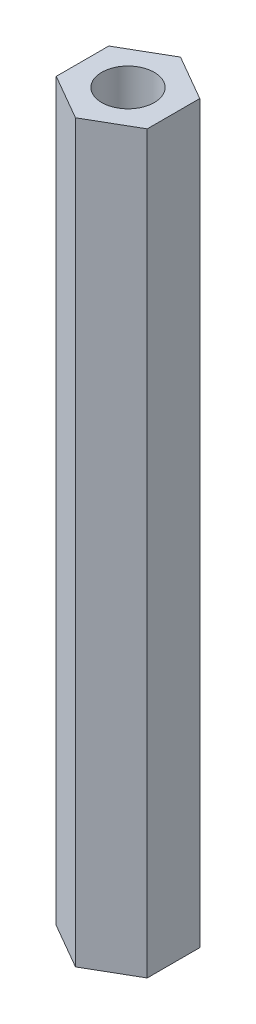
ISO-10303-21;
HEADER;
FILE_DESCRIPTION(('STEP AP214'),'2;1');
FILE_NAME('part.step','',(''),(''),'','','');
FILE_SCHEMA(('AUTOMOTIVE_DESIGN { 1 0 10303 214 1 1 1 1 }'));
ENDSEC;
DATA;
#1=APPLICATION_CONTEXT('core data for automotive mechanical design processes');
#2=APPLICATION_PROTOCOL_DEFINITION('international standard','automotive_design',2000,#1);
#3=PRODUCT_CONTEXT('',#1,'mechanical');
#4=PRODUCT('Part','Part','',(#3));
#5=PRODUCT_RELATED_PRODUCT_CATEGORY('part','',(#4));
#6=PRODUCT_DEFINITION_FORMATION('','',#4);
#7=PRODUCT_DEFINITION_CONTEXT('part definition',#1,'design');
#8=PRODUCT_DEFINITION('design','',#6,#7);
#9=PRODUCT_DEFINITION_SHAPE('','',#8);
#10=(LENGTH_UNIT() NAMED_UNIT(*) SI_UNIT(.MILLI.,.METRE.));
#11=(NAMED_UNIT(*) PLANE_ANGLE_UNIT() SI_UNIT($,.RADIAN.));
#12=(NAMED_UNIT(*) SI_UNIT($,.STERADIAN.) SOLID_ANGLE_UNIT());
#13=UNCERTAINTY_MEASURE_WITH_UNIT(LENGTH_MEASURE(1.E-05),#10,'distance_accuracy_value','');
#14=(GEOMETRIC_REPRESENTATION_CONTEXT(3) GLOBAL_UNCERTAINTY_ASSIGNED_CONTEXT((#13)) GLOBAL_UNIT_ASSIGNED_CONTEXT((#10,
#11,#12)) REPRESENTATION_CONTEXT('',''));
#15=CARTESIAN_POINT('',(0.,0.,0.));
#16=DIRECTION('',(0.,0.,1.));
#17=DIRECTION('',(1.,0.,0.));
#18=AXIS2_PLACEMENT_3D('',#15,#16,#17);
#19=CARTESIAN_POINT('',(0.,70.,-5.));
#20=DIRECTION('',(0.,1.,0.));
#21=DIRECTION('',(0.,0.,1.));
#22=AXIS2_PLACEMENT_3D('',#19,#20,#21);
#23=PLANE('',#22);
#24=DIRECTION('',(-0.866025403784439,0.,-0.5));
#25=VECTOR('',#24,1.);
#26=CARTESIAN_POINT('',(4.33012701892219,70.,-2.5));
#27=LINE('',#26,#25);
#28=CARTESIAN_POINT('',(4.33012701892219,70.,-2.5));
#29=VERTEX_POINT('',#28);
#30=CARTESIAN_POINT('',(0.,70.,-5.));
#31=VERTEX_POINT('',#30);
#32=EDGE_CURVE('E127',#29,#31,#27,.T.);
#33=ORIENTED_EDGE('',*,*,#32,.T.);
#34=DIRECTION('',(-0.866025403784439,0.,0.5));
#35=VECTOR('',#34,1.);
#36=CARTESIAN_POINT('',(0.,70.,-5.));
#37=LINE('',#36,#35);
#38=CARTESIAN_POINT('',(-4.33012701892219,70.,-2.5));
#39=VERTEX_POINT('',#38);
#40=EDGE_CURVE('E85',#31,#39,#37,.T.);
#41=ORIENTED_EDGE('',*,*,#40,.T.);
#42=DIRECTION('',(0.,0.,1.));
#43=VECTOR('',#42,1.);
#44=CARTESIAN_POINT('',(-4.33012701892219,70.,-2.5));
#45=LINE('',#44,#43);
#46=CARTESIAN_POINT('',(-4.33012701892219,70.,2.5));
#47=VERTEX_POINT('',#46);
#48=EDGE_CURVE('E98',#39,#47,#45,.T.);
#49=ORIENTED_EDGE('',*,*,#48,.T.);
#50=DIRECTION('',(0.866025403784439,0.,0.5));
#51=VECTOR('',#50,1.);
#52=CARTESIAN_POINT('',(-4.33012701892219,70.,2.5));
#53=LINE('',#52,#51);
#54=CARTESIAN_POINT('',(0.,70.,5.));
#55=VERTEX_POINT('',#54);
#56=EDGE_CURVE('E92',#47,#55,#53,.T.);
#57=ORIENTED_EDGE('',*,*,#56,.T.);
#58=DIRECTION('',(0.866025403784439,0.,-0.5));
#59=VECTOR('',#58,1.);
#60=CARTESIAN_POINT('',(0.,70.,5.));
#61=LINE('',#60,#59);
#62=CARTESIAN_POINT('',(4.33012701892219,70.,2.5));
#63=VERTEX_POINT('',#62);
#64=EDGE_CURVE('E96',#55,#63,#61,.T.);
#65=ORIENTED_EDGE('',*,*,#64,.T.);
#66=DIRECTION('',(0.,0.,-1.));
#67=VECTOR('',#66,1.);
#68=CARTESIAN_POINT('',(4.33012701892219,70.,2.5));
#69=LINE('',#68,#67);
#70=EDGE_CURVE('E48',#63,#29,#69,.T.);
#71=ORIENTED_EDGE('',*,*,#70,.T.);
#72=EDGE_LOOP('',(#33,#41,#49,#57,#65,#71));
#73=FACE_BOUND('',#72,.T.);
#74=CARTESIAN_POINT('',(0.,70.,0.));
#75=DIRECTION('',(0.,1.,0.));
#76=DIRECTION('',(0.,0.,1.));
#77=AXIS2_PLACEMENT_3D('',#74,#75,#76);
#78=CIRCLE('',#77,2.5);
#79=CARTESIAN_POINT('',(0.,70.,2.5));
#80=VERTEX_POINT('',#79);
#81=EDGE_CURVE('E120',#80,#80,#78,.T.);
#82=ORIENTED_EDGE('',*,*,#81,.F.);
#83=EDGE_LOOP('',(#82));
#84=FACE_BOUND('',#83,.T.);
#85=ADVANCED_FACE('F31',(#73,#84),#23,.T.);
#86=CARTESIAN_POINT('',(0.,0.,-5.));
#87=DIRECTION('',(0.,1.,0.));
#88=DIRECTION('',(0.,0.,1.));
#89=AXIS2_PLACEMENT_3D('',#86,#87,#88);
#90=PLANE('',#89);
#91=DIRECTION('',(-0.866025403784439,0.,-0.5));
#92=VECTOR('',#91,1.);
#93=CARTESIAN_POINT('',(4.33012701892219,0.,-2.5));
#94=LINE('',#93,#92);
#95=CARTESIAN_POINT('',(4.33012701892219,0.,-2.5));
#96=VERTEX_POINT('',#95);
#97=CARTESIAN_POINT('',(0.,0.,-5.));
#98=VERTEX_POINT('',#97);
#99=EDGE_CURVE('E116',#96,#98,#94,.T.);
#100=ORIENTED_EDGE('',*,*,#99,.F.);
#101=DIRECTION('',(0.,0.,-1.));
#102=VECTOR('',#101,1.);
#103=CARTESIAN_POINT('',(4.33012701892219,0.,2.5));
#104=LINE('',#103,#102);
#105=CARTESIAN_POINT('',(4.33012701892219,0.,2.5));
#106=VERTEX_POINT('',#105);
#107=EDGE_CURVE('E77',#106,#96,#104,.T.);
#108=ORIENTED_EDGE('',*,*,#107,.F.);
#109=DIRECTION('',(0.866025403784439,0.,-0.5));
#110=VECTOR('',#109,1.);
#111=CARTESIAN_POINT('',(0.,0.,5.));
#112=LINE('',#111,#110);
#113=CARTESIAN_POINT('',(0.,0.,5.));
#114=VERTEX_POINT('',#113);
#115=EDGE_CURVE('E71',#114,#106,#112,.T.);
#116=ORIENTED_EDGE('',*,*,#115,.F.);
#117=DIRECTION('',(0.866025403784439,0.,0.5));
#118=VECTOR('',#117,1.);
#119=CARTESIAN_POINT('',(-4.33012701892219,0.,2.5));
#120=LINE('',#119,#118);
#121=CARTESIAN_POINT('',(-4.33012701892219,0.,2.5));
#122=VERTEX_POINT('',#121);
#123=EDGE_CURVE('E106',#122,#114,#120,.T.);
#124=ORIENTED_EDGE('',*,*,#123,.F.);
#125=DIRECTION('',(0.,0.,1.));
#126=VECTOR('',#125,1.);
#127=CARTESIAN_POINT('',(-4.33012701892219,0.,-2.5));
#128=LINE('',#127,#126);
#129=CARTESIAN_POINT('',(-4.33012701892219,0.,-2.5));
#130=VERTEX_POINT('',#129);
#131=EDGE_CURVE('E122',#130,#122,#128,.T.);
#132=ORIENTED_EDGE('',*,*,#131,.F.);
#133=DIRECTION('',(-0.866025403784439,0.,0.5));
#134=VECTOR('',#133,1.);
#135=CARTESIAN_POINT('',(0.,0.,-5.));
#136=LINE('',#135,#134);
#137=EDGE_CURVE('E119',#98,#130,#136,.T.);
#138=ORIENTED_EDGE('',*,*,#137,.F.);
#139=EDGE_LOOP('',(#100,#108,#116,#124,#132,#138));
#140=FACE_BOUND('',#139,.T.);
#141=CARTESIAN_POINT('',(0.,0.,0.));
#142=DIRECTION('',(0.,1.,0.));
#143=DIRECTION('',(0.,0.,1.));
#144=AXIS2_PLACEMENT_3D('',#141,#142,#143);
#145=CIRCLE('',#144,2.5);
#146=CARTESIAN_POINT('',(0.,0.,2.5));
#147=VERTEX_POINT('',#146);
#148=EDGE_CURVE('E220',#147,#147,#145,.T.);
#149=ORIENTED_EDGE('',*,*,#148,.T.);
#150=EDGE_LOOP('',(#149));
#151=FACE_BOUND('',#150,.T.);
#152=ADVANCED_FACE('F136',(#140,#151),#90,.F.);
#153=CARTESIAN_POINT('',(4.33012701892219,70.,-2.5));
#154=DIRECTION('',(-0.5,0.,0.866025403784439));
#155=DIRECTION('',(0.866025403784439,0.,0.5));
#156=AXIS2_PLACEMENT_3D('',#153,#154,#155);
#157=PLANE('',#156);
#158=ORIENTED_EDGE('',*,*,#99,.T.);
#159=DIRECTION('',(0.,-1.,0.));
#160=VECTOR('',#159,1.);
#161=CARTESIAN_POINT('',(0.,70.,-5.));
#162=LINE('',#161,#160);
#163=EDGE_CURVE('E11',#31,#98,#162,.T.);
#164=ORIENTED_EDGE('',*,*,#163,.F.);
#165=ORIENTED_EDGE('',*,*,#32,.F.);
#166=DIRECTION('',(0.,-1.,0.));
#167=VECTOR('',#166,1.);
#168=CARTESIAN_POINT('',(4.33012701892219,70.,-2.5));
#169=LINE('',#168,#167);
#170=EDGE_CURVE('E112',#29,#96,#169,.T.);
#171=ORIENTED_EDGE('',*,*,#170,.T.);
#172=EDGE_LOOP('',(#158,#164,#165,#171));
#173=FACE_BOUND('',#172,.T.);
#174=ADVANCED_FACE('F33',(#173),#157,.F.);
#175=CARTESIAN_POINT('',(0.,70.,-5.));
#176=DIRECTION('',(0.5,0.,0.866025403784439));
#177=DIRECTION('',(0.866025403784439,0.,-0.5));
#178=AXIS2_PLACEMENT_3D('',#175,#176,#177);
#179=PLANE('',#178);
#180=ORIENTED_EDGE('',*,*,#137,.T.);
#181=DIRECTION('',(0.,-1.,0.));
#182=VECTOR('',#181,1.);
#183=CARTESIAN_POINT('',(-4.33012701892219,70.,-2.5));
#184=LINE('',#183,#182);
#185=EDGE_CURVE('E40',#39,#130,#184,.T.);
#186=ORIENTED_EDGE('',*,*,#185,.F.);
#187=ORIENTED_EDGE('',*,*,#40,.F.);
#188=ORIENTED_EDGE('',*,*,#163,.T.);
#189=EDGE_LOOP('',(#180,#186,#187,#188));
#190=FACE_BOUND('',#189,.T.);
#191=ADVANCED_FACE('F161',(#190),#179,.F.);
#192=CARTESIAN_POINT('',(-4.33012701892219,70.,-2.5));
#193=DIRECTION('',(1.,0.,0.));
#194=DIRECTION('',(0.,0.,-1.));
#195=AXIS2_PLACEMENT_3D('',#192,#193,#194);
#196=PLANE('',#195);
#197=ORIENTED_EDGE('',*,*,#131,.T.);
#198=DIRECTION('',(0.,-1.,0.));
#199=VECTOR('',#198,1.);
#200=CARTESIAN_POINT('',(-4.33012701892219,70.,2.5));
#201=LINE('',#200,#199);
#202=EDGE_CURVE('E107',#47,#122,#201,.T.);
#203=ORIENTED_EDGE('',*,*,#202,.F.);
#204=ORIENTED_EDGE('',*,*,#48,.F.);
#205=ORIENTED_EDGE('',*,*,#185,.T.);
#206=EDGE_LOOP('',(#197,#203,#204,#205));
#207=FACE_BOUND('',#206,.T.);
#208=ADVANCED_FACE('F133',(#207),#196,.F.);
#209=CARTESIAN_POINT('',(-4.33012701892219,70.,2.5));
#210=DIRECTION('',(0.5,0.,-0.866025403784439));
#211=DIRECTION('',(-0.866025403784439,0.,-0.5));
#212=AXIS2_PLACEMENT_3D('',#209,#210,#211);
#213=PLANE('',#212);
#214=ORIENTED_EDGE('',*,*,#123,.T.);
#215=DIRECTION('',(0.,-1.,0.));
#216=VECTOR('',#215,1.);
#217=CARTESIAN_POINT('',(0.,70.,5.));
#218=LINE('',#217,#216);
#219=EDGE_CURVE('E103',#55,#114,#218,.T.);
#220=ORIENTED_EDGE('',*,*,#219,.F.);
#221=ORIENTED_EDGE('',*,*,#56,.F.);
#222=ORIENTED_EDGE('',*,*,#202,.T.);
#223=EDGE_LOOP('',(#214,#220,#221,#222));
#224=FACE_BOUND('',#223,.T.);
#225=ADVANCED_FACE('F104',(#224),#213,.F.);
#226=CARTESIAN_POINT('',(0.,70.,5.));
#227=DIRECTION('',(-0.5,0.,-0.866025403784439));
#228=DIRECTION('',(-0.866025403784439,0.,0.5));
#229=AXIS2_PLACEMENT_3D('',#226,#227,#228);
#230=PLANE('',#229);
#231=ORIENTED_EDGE('',*,*,#115,.T.);
#232=DIRECTION('',(0.,-1.,0.));
#233=VECTOR('',#232,1.);
#234=CARTESIAN_POINT('',(4.33012701892219,70.,2.5));
#235=LINE('',#234,#233);
#236=EDGE_CURVE('E108',#63,#106,#235,.T.);
#237=ORIENTED_EDGE('',*,*,#236,.F.);
#238=ORIENTED_EDGE('',*,*,#64,.F.);
#239=ORIENTED_EDGE('',*,*,#219,.T.);
#240=EDGE_LOOP('',(#231,#237,#238,#239));
#241=FACE_BOUND('',#240,.T.);
#242=ADVANCED_FACE('F110',(#241),#230,.F.);
#243=CARTESIAN_POINT('',(4.33012701892219,70.,2.5));
#244=DIRECTION('',(-1.,0.,0.));
#245=DIRECTION('',(0.,0.,1.));
#246=AXIS2_PLACEMENT_3D('',#243,#244,#245);
#247=PLANE('',#246);
#248=ORIENTED_EDGE('',*,*,#107,.T.);
#249=ORIENTED_EDGE('',*,*,#170,.F.);
#250=ORIENTED_EDGE('',*,*,#70,.F.);
#251=ORIENTED_EDGE('',*,*,#236,.T.);
#252=EDGE_LOOP('',(#248,#249,#250,#251));
#253=FACE_BOUND('',#252,.T.);
#254=ADVANCED_FACE('F141',(#253),#247,.F.);
#255=CARTESIAN_POINT('',(0.,70.,0.));
#256=DIRECTION('',(0.,-1.,0.));
#257=DIRECTION('',(0.,0.,-1.));
#258=AXIS2_PLACEMENT_3D('',#255,#256,#257);
#259=CYLINDRICAL_SURFACE('',#258,2.5);
#260=ORIENTED_EDGE('',*,*,#81,.T.);
#261=EDGE_LOOP('',(#260));
#262=FACE_BOUND('',#261,.T.);
#263=ORIENTED_EDGE('',*,*,#148,.F.);
#264=EDGE_LOOP('',(#263));
#265=FACE_BOUND('',#264,.T.);
#266=ADVANCED_FACE('F143',(#262,#265),#259,.F.);
#267=CLOSED_SHELL('',(#85,#152,#174,#191,#208,#225,#242,#254,#266));
#268=MANIFOLD_SOLID_BREP('B2',#267);
#269=ADVANCED_BREP_SHAPE_REPRESENTATION('',(#18,#268),#14);
#270=SHAPE_DEFINITION_REPRESENTATION(#9,#269);
ENDSEC;
END-ISO-10303-21;
